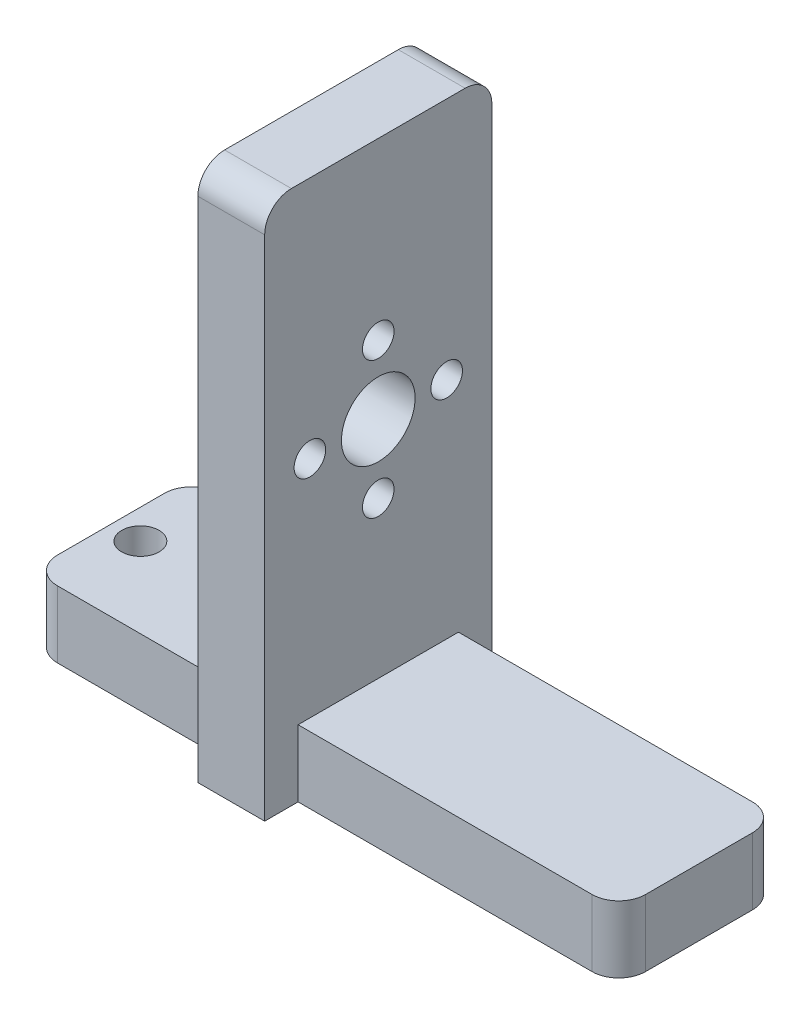
ISO-10303-21;
HEADER;
FILE_DESCRIPTION(('STEP AP214'),'2;1');
FILE_NAME('part.step','',(''),(''),'','','');
FILE_SCHEMA(('AUTOMOTIVE_DESIGN { 1 0 10303 214 1 1 1 1 }'));
ENDSEC;
DATA;
#1=APPLICATION_CONTEXT('core data for automotive mechanical design processes');
#2=APPLICATION_PROTOCOL_DEFINITION('international standard','automotive_design',2000,#1);
#3=PRODUCT_CONTEXT('',#1,'mechanical');
#4=PRODUCT('Part','Part','',(#3));
#5=PRODUCT_RELATED_PRODUCT_CATEGORY('part','',(#4));
#6=PRODUCT_DEFINITION_FORMATION('','',#4);
#7=PRODUCT_DEFINITION_CONTEXT('part definition',#1,'design');
#8=PRODUCT_DEFINITION('design','',#6,#7);
#9=PRODUCT_DEFINITION_SHAPE('','',#8);
#10=(LENGTH_UNIT() NAMED_UNIT(*) SI_UNIT(.MILLI.,.METRE.));
#11=(NAMED_UNIT(*) PLANE_ANGLE_UNIT() SI_UNIT($,.RADIAN.));
#12=(NAMED_UNIT(*) SI_UNIT($,.STERADIAN.) SOLID_ANGLE_UNIT());
#13=UNCERTAINTY_MEASURE_WITH_UNIT(LENGTH_MEASURE(1.E-05),#10,'distance_accuracy_value','');
#14=(GEOMETRIC_REPRESENTATION_CONTEXT(3) GLOBAL_UNCERTAINTY_ASSIGNED_CONTEXT((#13)) GLOBAL_UNIT_ASSIGNED_CONTEXT((#10,
#11,#12)) REPRESENTATION_CONTEXT('',''));
#15=CARTESIAN_POINT('',(0.,0.,0.));
#16=DIRECTION('',(0.,0.,1.));
#17=DIRECTION('',(1.,0.,0.));
#18=AXIS2_PLACEMENT_3D('',#15,#16,#17);
#19=CARTESIAN_POINT('',(0.,0.,15.24));
#20=DIRECTION('',(0.,0.,1.));
#21=DIRECTION('',(1.,0.,0.));
#22=AXIS2_PLACEMENT_3D('',#19,#20,#21);
#23=PLANE('',#22);
#24=DIRECTION('',(1.,0.,0.));
#25=VECTOR('',#24,1.);
#26=CARTESIAN_POINT('',(-27.94,0.,15.24));
#27=LINE('',#26,#25);
#28=CARTESIAN_POINT('',(-2.54,0.,15.24));
#29=VERTEX_POINT('',#28);
#30=CARTESIAN_POINT('',(25.4,0.,15.24));
#31=VERTEX_POINT('',#30);
#32=EDGE_CURVE('E182',#29,#31,#27,.T.);
#33=ORIENTED_EDGE('',*,*,#32,.T.);
#34=DIRECTION('',(0.,1.,0.));
#35=VECTOR('',#34,1.);
#36=CARTESIAN_POINT('',(25.4,6.35,15.24));
#37=LINE('',#36,#35);
#38=CARTESIAN_POINT('',(25.4,6.35,15.24));
#39=VERTEX_POINT('',#38);
#40=EDGE_CURVE('E193',#31,#39,#37,.T.);
#41=ORIENTED_EDGE('',*,*,#40,.T.);
#42=DIRECTION('',(-1.,0.,0.));
#43=VECTOR('',#42,1.);
#44=CARTESIAN_POINT('',(27.94,6.35,15.24));
#45=LINE('',#44,#43);
#46=CARTESIAN_POINT('',(-2.54,6.34999999999999,15.24));
#47=VERTEX_POINT('',#46);
#48=EDGE_CURVE('E234',#39,#47,#45,.T.);
#49=ORIENTED_EDGE('',*,*,#48,.T.);
#50=DIRECTION('',(0.,-1.,0.));
#51=VECTOR('',#50,1.);
#52=CARTESIAN_POINT('',(-2.54,50.8,15.24));
#53=LINE('',#52,#51);
#54=EDGE_CURVE('E187',#47,#29,#53,.T.);
#55=ORIENTED_EDGE('',*,*,#54,.T.);
#56=EDGE_LOOP('',(#33,#41,#49,#55));
#57=FACE_BOUND('',#56,.T.);
#58=ADVANCED_FACE('F33',(#57),#23,.T.);
#59=CARTESIAN_POINT('',(0.,0.,0.));
#60=DIRECTION('',(0.,0.,1.));
#61=DIRECTION('',(1.,0.,0.));
#62=AXIS2_PLACEMENT_3D('',#59,#60,#61);
#63=PLANE('',#62);
#64=DIRECTION('',(1.,0.,0.));
#65=VECTOR('',#64,1.);
#66=CARTESIAN_POINT('',(-27.94,0.,0.));
#67=LINE('',#66,#65);
#68=CARTESIAN_POINT('',(-25.4,0.,0.));
#69=VERTEX_POINT('',#68);
#70=CARTESIAN_POINT('',(-8.89,0.,0.));
#71=VERTEX_POINT('',#70);
#72=EDGE_CURVE('E240',#69,#71,#67,.T.);
#73=ORIENTED_EDGE('',*,*,#72,.F.);
#74=DIRECTION('',(0.,-1.,0.));
#75=VECTOR('',#74,1.);
#76=CARTESIAN_POINT('',(-25.4,0.,0.));
#77=LINE('',#76,#75);
#78=CARTESIAN_POINT('',(-25.4,6.35,0.));
#79=VERTEX_POINT('',#78);
#80=EDGE_CURVE('E302',#69,#79,#77,.F.);
#81=ORIENTED_EDGE('',*,*,#80,.T.);
#82=DIRECTION('',(-1.,0.,0.));
#83=VECTOR('',#82,1.);
#84=CARTESIAN_POINT('',(-8.89,6.35,0.));
#85=LINE('',#84,#83);
#86=CARTESIAN_POINT('',(-8.89,6.35,0.));
#87=VERTEX_POINT('',#86);
#88=EDGE_CURVE('E244',#87,#79,#85,.T.);
#89=ORIENTED_EDGE('',*,*,#88,.F.);
#90=DIRECTION('',(0.,1.,0.));
#91=VECTOR('',#90,1.);
#92=CARTESIAN_POINT('',(-8.89,50.8,0.));
#93=LINE('',#92,#91);
#94=EDGE_CURVE('E170',#71,#87,#93,.T.);
#95=ORIENTED_EDGE('',*,*,#94,.F.);
#96=EDGE_LOOP('',(#73,#81,#89,#95));
#97=FACE_BOUND('',#96,.T.);
#98=ADVANCED_FACE('F350',(#97),#63,.F.);
#99=CARTESIAN_POINT('',(-27.94,6.35,15.24));
#100=DIRECTION('',(1.,0.,0.));
#101=DIRECTION('',(0.,0.,-1.));
#102=AXIS2_PLACEMENT_3D('',#99,#100,#101);
#103=PLANE('',#102);
#104=DIRECTION('',(0.,0.,-1.));
#105=VECTOR('',#104,1.);
#106=CARTESIAN_POINT('',(-27.94,0.,15.24));
#107=LINE('',#106,#105);
#108=CARTESIAN_POINT('',(-27.94,0.,12.7));
#109=VERTEX_POINT('',#108);
#110=CARTESIAN_POINT('',(-27.94,0.,2.54));
#111=VERTEX_POINT('',#110);
#112=EDGE_CURVE('E266',#109,#111,#107,.T.);
#113=ORIENTED_EDGE('',*,*,#112,.F.);
#114=DIRECTION('',(0.,-1.,0.));
#115=VECTOR('',#114,1.);
#116=CARTESIAN_POINT('',(-27.94,6.35,12.7));
#117=LINE('',#116,#115);
#118=CARTESIAN_POINT('',(-27.94,6.35,12.7));
#119=VERTEX_POINT('',#118);
#120=EDGE_CURVE('E296',#109,#119,#117,.F.);
#121=ORIENTED_EDGE('',*,*,#120,.T.);
#122=DIRECTION('',(0.,0.,-1.));
#123=VECTOR('',#122,1.);
#124=CARTESIAN_POINT('',(-27.94,6.35,15.24));
#125=LINE('',#124,#123);
#126=CARTESIAN_POINT('',(-27.94,6.35,2.54));
#127=VERTEX_POINT('',#126);
#128=EDGE_CURVE('E239',#119,#127,#125,.T.);
#129=ORIENTED_EDGE('',*,*,#128,.T.);
#130=DIRECTION('',(0.,-1.,0.));
#131=VECTOR('',#130,1.);
#132=CARTESIAN_POINT('',(-27.94,6.35,2.54));
#133=LINE('',#132,#131);
#134=EDGE_CURVE('E293',#127,#111,#133,.T.);
#135=ORIENTED_EDGE('',*,*,#134,.T.);
#136=EDGE_LOOP('',(#113,#121,#129,#135));
#137=FACE_BOUND('',#136,.T.);
#138=ADVANCED_FACE('F337',(#137),#103,.F.);
#139=CARTESIAN_POINT('',(-27.94,0.,15.24));
#140=DIRECTION('',(0.,1.,0.));
#141=DIRECTION('',(0.,0.,1.));
#142=AXIS2_PLACEMENT_3D('',#139,#140,#141);
#143=PLANE('',#142);
#144=CARTESIAN_POINT('',(-25.146,0.,7.62));
#145=DIRECTION('',(0.,1.,0.));
#146=DIRECTION('',(0.,0.,1.));
#147=AXIS2_PLACEMENT_3D('',#144,#145,#146);
#148=CIRCLE('',#147,1.778);
#149=CARTESIAN_POINT('',(-25.146,0.,9.398));
#150=VERTEX_POINT('',#149);
#151=EDGE_CURVE('E222',#150,#150,#148,.T.);
#152=ORIENTED_EDGE('',*,*,#151,.T.);
#153=EDGE_LOOP('',(#152));
#154=FACE_BOUND('',#153,.T.);
#155=CARTESIAN_POINT('',(-15.24,0.,7.62));
#156=DIRECTION('',(0.,1.,0.));
#157=DIRECTION('',(0.,0.,1.));
#158=AXIS2_PLACEMENT_3D('',#155,#156,#157);
#159=CIRCLE('',#158,1.778);
#160=CARTESIAN_POINT('',(-15.24,0.,9.398));
#161=VERTEX_POINT('',#160);
#162=EDGE_CURVE('E217',#161,#161,#159,.T.);
#163=ORIENTED_EDGE('',*,*,#162,.T.);
#164=EDGE_LOOP('',(#163));
#165=FACE_BOUND('',#164,.T.);
#166=DIRECTION('',(0.,0.,-1.));
#167=VECTOR('',#166,1.);
#168=CARTESIAN_POINT('',(27.94,0.,15.24));
#169=LINE('',#168,#167);
#170=CARTESIAN_POINT('',(27.94,0.,12.7));
#171=VERTEX_POINT('',#170);
#172=CARTESIAN_POINT('',(27.94,0.,2.54));
#173=VERTEX_POINT('',#172);
#174=EDGE_CURVE('E263',#171,#173,#169,.T.);
#175=ORIENTED_EDGE('',*,*,#174,.F.);
#176=CARTESIAN_POINT('',(25.4,0.,12.7));
#177=DIRECTION('',(0.,1.,0.));
#178=DIRECTION('',(0.,0.,1.));
#179=AXIS2_PLACEMENT_3D('',#176,#177,#178);
#180=CIRCLE('',#179,2.54);
#181=EDGE_CURVE('E286',#171,#31,#180,.F.);
#182=ORIENTED_EDGE('',*,*,#181,.T.);
#183=ORIENTED_EDGE('',*,*,#32,.F.);
#184=DIRECTION('',(0.,0.,1.));
#185=VECTOR('',#184,1.);
#186=CARTESIAN_POINT('',(-2.54,0.,15.24));
#187=LINE('',#186,#185);
#188=CARTESIAN_POINT('',(-2.54,0.,18.415));
#189=VERTEX_POINT('',#188);
#190=EDGE_CURVE('E174',#29,#189,#187,.T.);
#191=ORIENTED_EDGE('',*,*,#190,.T.);
#192=DIRECTION('',(-1.,0.,0.));
#193=VECTOR('',#192,1.);
#194=CARTESIAN_POINT('',(-2.54,0.,18.415));
#195=LINE('',#194,#193);
#196=CARTESIAN_POINT('',(-8.89,0.,18.415));
#197=VERTEX_POINT('',#196);
#198=EDGE_CURVE('E158',#189,#197,#195,.T.);
#199=ORIENTED_EDGE('',*,*,#198,.T.);
#200=DIRECTION('',(0.,0.,1.));
#201=VECTOR('',#200,1.);
#202=CARTESIAN_POINT('',(-8.89,0.,15.24));
#203=LINE('',#202,#201);
#204=CARTESIAN_POINT('',(-8.89,0.,15.24));
#205=VERTEX_POINT('',#204);
#206=EDGE_CURVE('E184',#205,#197,#203,.T.);
#207=ORIENTED_EDGE('',*,*,#206,.F.);
#208=CARTESIAN_POINT('',(-25.4,0.,15.24));
#209=VERTEX_POINT('',#208);
#210=EDGE_CURVE('E232',#209,#205,#27,.T.);
#211=ORIENTED_EDGE('',*,*,#210,.F.);
#212=CARTESIAN_POINT('',(-25.4,0.,12.7));
#213=DIRECTION('',(0.,1.,0.));
#214=DIRECTION('',(0.,0.,1.));
#215=AXIS2_PLACEMENT_3D('',#212,#213,#214);
#216=CIRCLE('',#215,2.54);
#217=EDGE_CURVE('E282',#209,#109,#216,.F.);
#218=ORIENTED_EDGE('',*,*,#217,.T.);
#219=ORIENTED_EDGE('',*,*,#112,.T.);
#220=CARTESIAN_POINT('',(-25.4,0.,2.54));
#221=DIRECTION('',(0.,1.,0.));
#222=DIRECTION('',(0.,0.,1.));
#223=AXIS2_PLACEMENT_3D('',#220,#221,#222);
#224=CIRCLE('',#223,2.54);
#225=EDGE_CURVE('E280',#111,#69,#224,.F.);
#226=ORIENTED_EDGE('',*,*,#225,.T.);
#227=ORIENTED_EDGE('',*,*,#72,.T.);
#228=DIRECTION('',(0.,0.,1.));
#229=VECTOR('',#228,1.);
#230=CARTESIAN_POINT('',(-8.89,0.,0.));
#231=LINE('',#230,#229);
#232=CARTESIAN_POINT('',(-8.89,0.,-3.17499999999999));
#233=VERTEX_POINT('',#232);
#234=EDGE_CURVE('E200',#233,#71,#231,.T.);
#235=ORIENTED_EDGE('',*,*,#234,.F.);
#236=DIRECTION('',(-1.,0.,0.));
#237=VECTOR('',#236,1.);
#238=CARTESIAN_POINT('',(-2.54,0.,-3.17499999999999));
#239=LINE('',#238,#237);
#240=CARTESIAN_POINT('',(-2.54,0.,-3.17499999999999));
#241=VERTEX_POINT('',#240);
#242=EDGE_CURVE('E205',#241,#233,#239,.T.);
#243=ORIENTED_EDGE('',*,*,#242,.F.);
#244=DIRECTION('',(0.,0.,1.));
#245=VECTOR('',#244,1.);
#246=CARTESIAN_POINT('',(-2.54,0.,0.));
#247=LINE('',#246,#245);
#248=CARTESIAN_POINT('',(-2.54,0.,0.));
#249=VERTEX_POINT('',#248);
#250=EDGE_CURVE('E202',#241,#249,#247,.T.);
#251=ORIENTED_EDGE('',*,*,#250,.T.);
#252=CARTESIAN_POINT('',(25.4,0.,0.));
#253=VERTEX_POINT('',#252);
#254=EDGE_CURVE('E231',#249,#253,#67,.T.);
#255=ORIENTED_EDGE('',*,*,#254,.T.);
#256=CARTESIAN_POINT('',(25.4,0.,2.54));
#257=DIRECTION('',(0.,1.,0.));
#258=DIRECTION('',(0.,0.,1.));
#259=AXIS2_PLACEMENT_3D('',#256,#257,#258);
#260=CIRCLE('',#259,2.54);
#261=EDGE_CURVE('E284',#253,#173,#260,.F.);
#262=ORIENTED_EDGE('',*,*,#261,.T.);
#263=EDGE_LOOP('',(#175,#182,#183,#191,#199,#207,#211,#218,#219,#226,#227,#235,#243,#251,#255,#262));
#264=FACE_BOUND('',#263,.T.);
#265=ADVANCED_FACE('F180',(#154,#165,#264),#143,.F.);
#266=CARTESIAN_POINT('',(27.94,0.,15.24));
#267=DIRECTION('',(-1.,0.,0.));
#268=DIRECTION('',(0.,0.,1.));
#269=AXIS2_PLACEMENT_3D('',#266,#267,#268);
#270=PLANE('',#269);
#271=DIRECTION('',(0.,0.,-1.));
#272=VECTOR('',#271,1.);
#273=CARTESIAN_POINT('',(27.94,6.35,15.24));
#274=LINE('',#273,#272);
#275=CARTESIAN_POINT('',(27.94,6.35,12.7));
#276=VERTEX_POINT('',#275);
#277=CARTESIAN_POINT('',(27.94,6.35,2.54));
#278=VERTEX_POINT('',#277);
#279=EDGE_CURVE('E260',#276,#278,#274,.T.);
#280=ORIENTED_EDGE('',*,*,#279,.F.);
#281=DIRECTION('',(0.,1.,0.));
#282=VECTOR('',#281,1.);
#283=CARTESIAN_POINT('',(27.94,0.,12.7));
#284=LINE('',#283,#282);
#285=EDGE_CURVE('E278',#276,#171,#284,.F.);
#286=ORIENTED_EDGE('',*,*,#285,.T.);
#287=ORIENTED_EDGE('',*,*,#174,.T.);
#288=DIRECTION('',(0.,1.,0.));
#289=VECTOR('',#288,1.);
#290=CARTESIAN_POINT('',(27.94,0.,2.54));
#291=LINE('',#290,#289);
#292=EDGE_CURVE('E275',#173,#278,#291,.T.);
#293=ORIENTED_EDGE('',*,*,#292,.T.);
#294=EDGE_LOOP('',(#280,#286,#287,#293));
#295=FACE_BOUND('',#294,.T.);
#296=ADVANCED_FACE('F366',(#295),#270,.F.);
#297=CARTESIAN_POINT('',(27.94,6.35,15.24));
#298=DIRECTION('',(0.,-1.,0.));
#299=DIRECTION('',(1.,0.,0.));
#300=AXIS2_PLACEMENT_3D('',#297,#298,#299);
#301=PLANE('',#300);
#302=ORIENTED_EDGE('',*,*,#48,.F.);
#303=CARTESIAN_POINT('',(25.4,6.35,12.7));
#304=DIRECTION('',(0.,-1.,0.));
#305=DIRECTION('',(1.,0.,0.));
#306=AXIS2_PLACEMENT_3D('',#303,#304,#305);
#307=CIRCLE('',#306,2.54);
#308=EDGE_CURVE('E273',#39,#276,#307,.F.);
#309=ORIENTED_EDGE('',*,*,#308,.T.);
#310=ORIENTED_EDGE('',*,*,#279,.T.);
#311=CARTESIAN_POINT('',(25.4,6.35,2.54));
#312=DIRECTION('',(0.,-1.,0.));
#313=DIRECTION('',(1.,0.,0.));
#314=AXIS2_PLACEMENT_3D('',#311,#312,#313);
#315=CIRCLE('',#314,2.54);
#316=CARTESIAN_POINT('',(25.4,6.35,0.));
#317=VERTEX_POINT('',#316);
#318=EDGE_CURVE('E271',#278,#317,#315,.F.);
#319=ORIENTED_EDGE('',*,*,#318,.T.);
#320=DIRECTION('',(-1.,0.,0.));
#321=VECTOR('',#320,1.);
#322=CARTESIAN_POINT('',(27.94,6.35,0.));
#323=LINE('',#322,#321);
#324=CARTESIAN_POINT('',(-2.54,6.34999999999999,0.));
#325=VERTEX_POINT('',#324);
#326=EDGE_CURVE('E242',#317,#325,#323,.T.);
#327=ORIENTED_EDGE('',*,*,#326,.T.);
#328=DIRECTION('',(0.,0.,-1.));
#329=VECTOR('',#328,1.);
#330=CARTESIAN_POINT('',(-2.54,6.35,15.24));
#331=LINE('',#330,#329);
#332=EDGE_CURVE('E257',#47,#325,#331,.T.);
#333=ORIENTED_EDGE('',*,*,#332,.F.);
#334=EDGE_LOOP('',(#302,#309,#310,#319,#327,#333));
#335=FACE_BOUND('',#334,.T.);
#336=ADVANCED_FACE('F370',(#335),#301,.F.);
#337=CARTESIAN_POINT('',(-2.54,6.35,15.24));
#338=DIRECTION('',(-1.,0.,0.));
#339=DIRECTION('',(0.,-1.,0.));
#340=AXIS2_PLACEMENT_3D('',#337,#338,#339);
#341=PLANE('',#340);
#342=CARTESIAN_POINT('',(-2.54,27.686,1.12));
#343=DIRECTION('',(-1.,0.,0.));
#344=DIRECTION('',(0.,0.,1.));
#345=AXIS2_PLACEMENT_3D('',#342,#343,#344);
#346=CIRCLE('',#345,1.5);
#347=CARTESIAN_POINT('',(-2.54,27.686,2.62));
#348=VERTEX_POINT('',#347);
#349=EDGE_CURVE('E550',#348,#348,#346,.T.);
#350=ORIENTED_EDGE('',*,*,#349,.T.);
#351=EDGE_LOOP('',(#350));
#352=FACE_BOUND('',#351,.T.);
#353=CARTESIAN_POINT('',(-2.54,21.186,7.62));
#354=DIRECTION('',(-1.,0.,0.));
#355=DIRECTION('',(0.,1.,0.));
#356=AXIS2_PLACEMENT_3D('',#353,#354,#355);
#357=CIRCLE('',#356,1.5);
#358=CARTESIAN_POINT('',(-2.54,22.686,7.62));
#359=VERTEX_POINT('',#358);
#360=EDGE_CURVE('E554',#359,#359,#357,.T.);
#361=ORIENTED_EDGE('',*,*,#360,.T.);
#362=EDGE_LOOP('',(#361));
#363=FACE_BOUND('',#362,.T.);
#364=CARTESIAN_POINT('',(-2.54,27.6860000000001,14.12));
#365=DIRECTION('',(-1.,0.,0.));
#366=DIRECTION('',(0.,0.,-1.));
#367=AXIS2_PLACEMENT_3D('',#364,#365,#366);
#368=CIRCLE('',#367,1.5);
#369=CARTESIAN_POINT('',(-2.54,27.6860000000001,12.62));
#370=VERTEX_POINT('',#369);
#371=EDGE_CURVE('E564',#370,#370,#368,.T.);
#372=ORIENTED_EDGE('',*,*,#371,.T.);
#373=EDGE_LOOP('',(#372));
#374=FACE_BOUND('',#373,.T.);
#375=CARTESIAN_POINT('',(-2.54,34.186,7.62));
#376=DIRECTION('',(-1.,0.,0.));
#377=DIRECTION('',(0.,-1.,0.));
#378=AXIS2_PLACEMENT_3D('',#375,#376,#377);
#379=CIRCLE('',#378,1.5);
#380=CARTESIAN_POINT('',(-2.54,32.686,7.62));
#381=VERTEX_POINT('',#380);
#382=EDGE_CURVE('E194',#381,#381,#379,.T.);
#383=ORIENTED_EDGE('',*,*,#382,.T.);
#384=EDGE_LOOP('',(#383));
#385=FACE_BOUND('',#384,.T.);
#386=CARTESIAN_POINT('',(-2.54,27.686,7.62));
#387=DIRECTION('',(-1.,0.,0.));
#388=DIRECTION('',(0.,-1.,0.));
#389=AXIS2_PLACEMENT_3D('',#386,#387,#388);
#390=CIRCLE('',#389,3.5);
#391=CARTESIAN_POINT('',(-2.54,24.186,7.62));
#392=VERTEX_POINT('',#391);
#393=EDGE_CURVE('E228',#392,#392,#390,.T.);
#394=ORIENTED_EDGE('',*,*,#393,.T.);
#395=EDGE_LOOP('',(#394));
#396=FACE_BOUND('',#395,.T.);
#397=DIRECTION('',(0.,0.,-1.));
#398=VECTOR('',#397,1.);
#399=CARTESIAN_POINT('',(-2.54,50.8,15.24));
#400=LINE('',#399,#398);
#401=CARTESIAN_POINT('',(-2.54,50.8,15.875));
#402=VERTEX_POINT('',#401);
#403=CARTESIAN_POINT('',(-2.54,50.8,-0.634999999999991));
#404=VERTEX_POINT('',#403);
#405=EDGE_CURVE('E255',#402,#404,#400,.T.);
#406=ORIENTED_EDGE('',*,*,#405,.F.);
#407=CARTESIAN_POINT('',(-2.54,48.26,15.875));
#408=DIRECTION('',(-1.,0.,0.));
#409=DIRECTION('',(0.,-1.,0.));
#410=AXIS2_PLACEMENT_3D('',#407,#408,#409);
#411=CIRCLE('',#410,2.54);
#412=CARTESIAN_POINT('',(-2.54,48.26,18.415));
#413=VERTEX_POINT('',#412);
#414=EDGE_CURVE('E41',#402,#413,#411,.F.);
#415=ORIENTED_EDGE('',*,*,#414,.T.);
#416=DIRECTION('',(0.,1.,0.));
#417=VECTOR('',#416,1.);
#418=CARTESIAN_POINT('',(-2.54,50.8,18.415));
#419=LINE('',#418,#417);
#420=EDGE_CURVE('E162',#189,#413,#419,.T.);
#421=ORIENTED_EDGE('',*,*,#420,.F.);
#422=ORIENTED_EDGE('',*,*,#190,.F.);
#423=ORIENTED_EDGE('',*,*,#54,.F.);
#424=ORIENTED_EDGE('',*,*,#332,.T.);
#425=DIRECTION('',(0.,1.,0.));
#426=VECTOR('',#425,1.);
#427=CARTESIAN_POINT('',(-2.54,50.8,0.));
#428=LINE('',#427,#426);
#429=EDGE_CURVE('E196',#249,#325,#428,.T.);
#430=ORIENTED_EDGE('',*,*,#429,.F.);
#431=ORIENTED_EDGE('',*,*,#250,.F.);
#432=DIRECTION('',(0.,-1.,0.));
#433=VECTOR('',#432,1.);
#434=CARTESIAN_POINT('',(-2.54,50.8,-3.175));
#435=LINE('',#434,#433);
#436=CARTESIAN_POINT('',(-2.54,48.26,-3.175));
#437=VERTEX_POINT('',#436);
#438=EDGE_CURVE('E199',#437,#241,#435,.T.);
#439=ORIENTED_EDGE('',*,*,#438,.F.);
#440=CARTESIAN_POINT('',(-2.54,48.26,-0.634999999999998));
#441=DIRECTION('',(-1.,0.,0.));
#442=DIRECTION('',(0.,-1.,0.));
#443=AXIS2_PLACEMENT_3D('',#440,#441,#442);
#444=CIRCLE('',#443,2.54);
#445=EDGE_CURVE('E53',#437,#404,#444,.F.);
#446=ORIENTED_EDGE('',*,*,#445,.T.);
#447=EDGE_LOOP('',(#406,#415,#421,#422,#423,#424,#430,#431,#439,#446));
#448=FACE_BOUND('',#447,.T.);
#449=ADVANCED_FACE('F172',(#352,#363,#374,#385,#396,#448),#341,.F.);
#450=CARTESIAN_POINT('',(-2.54,50.8,15.24));
#451=DIRECTION('',(0.,-1.,0.));
#452=DIRECTION('',(0.,0.,-1.));
#453=AXIS2_PLACEMENT_3D('',#450,#451,#452);
#454=PLANE('',#453);
#455=DIRECTION('',(0.,0.,-1.));
#456=VECTOR('',#455,1.);
#457=CARTESIAN_POINT('',(-8.89,50.8,15.24));
#458=LINE('',#457,#456);
#459=CARTESIAN_POINT('',(-8.89,50.8,15.875));
#460=VERTEX_POINT('',#459);
#461=CARTESIAN_POINT('',(-8.89,50.8,-0.634999999999991));
#462=VERTEX_POINT('',#461);
#463=EDGE_CURVE('E252',#460,#462,#458,.T.);
#464=ORIENTED_EDGE('',*,*,#463,.F.);
#465=DIRECTION('',(-1.,0.,0.));
#466=VECTOR('',#465,1.);
#467=CARTESIAN_POINT('',(-2.54,50.8,15.875));
#468=LINE('',#467,#466);
#469=EDGE_CURVE('E313',#460,#402,#468,.F.);
#470=ORIENTED_EDGE('',*,*,#469,.T.);
#471=ORIENTED_EDGE('',*,*,#405,.T.);
#472=DIRECTION('',(-1.,0.,0.));
#473=VECTOR('',#472,1.);
#474=CARTESIAN_POINT('',(-8.89,50.8,-0.634999999999998));
#475=LINE('',#474,#473);
#476=EDGE_CURVE('E310',#404,#462,#475,.T.);
#477=ORIENTED_EDGE('',*,*,#476,.T.);
#478=EDGE_LOOP('',(#464,#470,#471,#477));
#479=FACE_BOUND('',#478,.T.);
#480=ADVANCED_FACE('F318',(#479),#454,.F.);
#481=CARTESIAN_POINT('',(-8.89,50.8,15.24));
#482=DIRECTION('',(1.,0.,0.));
#483=DIRECTION('',(0.,1.,0.));
#484=AXIS2_PLACEMENT_3D('',#481,#482,#483);
#485=PLANE('',#484);
#486=CARTESIAN_POINT('',(-8.89,27.686,1.12));
#487=DIRECTION('',(-1.,0.,0.));
#488=DIRECTION('',(0.,0.,1.));
#489=AXIS2_PLACEMENT_3D('',#486,#487,#488);
#490=CIRCLE('',#489,1.5);
#491=CARTESIAN_POINT('',(-8.89,27.686,2.62));
#492=VERTEX_POINT('',#491);
#493=EDGE_CURVE('E553',#492,#492,#490,.T.);
#494=ORIENTED_EDGE('',*,*,#493,.F.);
#495=EDGE_LOOP('',(#494));
#496=FACE_BOUND('',#495,.T.);
#497=CARTESIAN_POINT('',(-8.89,21.186,7.62));
#498=DIRECTION('',(-1.,0.,0.));
#499=DIRECTION('',(0.,1.,0.));
#500=AXIS2_PLACEMENT_3D('',#497,#498,#499);
#501=CIRCLE('',#500,1.5);
#502=CARTESIAN_POINT('',(-8.89,22.686,7.62));
#503=VERTEX_POINT('',#502);
#504=EDGE_CURVE('E559',#503,#503,#501,.T.);
#505=ORIENTED_EDGE('',*,*,#504,.F.);
#506=EDGE_LOOP('',(#505));
#507=FACE_BOUND('',#506,.T.);
#508=CARTESIAN_POINT('',(-8.89,27.6860000000001,14.12));
#509=DIRECTION('',(-1.,0.,0.));
#510=DIRECTION('',(0.,0.,-1.));
#511=AXIS2_PLACEMENT_3D('',#508,#509,#510);
#512=CIRCLE('',#511,1.5);
#513=CARTESIAN_POINT('',(-8.89,27.6860000000001,12.62));
#514=VERTEX_POINT('',#513);
#515=EDGE_CURVE('E567',#514,#514,#512,.T.);
#516=ORIENTED_EDGE('',*,*,#515,.F.);
#517=EDGE_LOOP('',(#516));
#518=FACE_BOUND('',#517,.T.);
#519=CARTESIAN_POINT('',(-8.89,34.186,7.62));
#520=DIRECTION('',(-1.,0.,0.));
#521=DIRECTION('',(0.,-1.,0.));
#522=AXIS2_PLACEMENT_3D('',#519,#520,#521);
#523=CIRCLE('',#522,1.5);
#524=CARTESIAN_POINT('',(-8.89,32.686,7.62));
#525=VERTEX_POINT('',#524);
#526=EDGE_CURVE('E556',#525,#525,#523,.T.);
#527=ORIENTED_EDGE('',*,*,#526,.F.);
#528=EDGE_LOOP('',(#527));
#529=FACE_BOUND('',#528,.T.);
#530=CARTESIAN_POINT('',(-8.89,27.686,7.62));
#531=DIRECTION('',(-1.,0.,0.));
#532=DIRECTION('',(0.,-1.,0.));
#533=AXIS2_PLACEMENT_3D('',#530,#531,#532);
#534=CIRCLE('',#533,3.5);
#535=CARTESIAN_POINT('',(-8.89,24.186,7.62));
#536=VERTEX_POINT('',#535);
#537=EDGE_CURVE('E225',#536,#536,#534,.T.);
#538=ORIENTED_EDGE('',*,*,#537,.F.);
#539=EDGE_LOOP('',(#538));
#540=FACE_BOUND('',#539,.T.);
#541=DIRECTION('',(0.,1.,0.));
#542=VECTOR('',#541,1.);
#543=CARTESIAN_POINT('',(-8.89,50.8,18.415));
#544=LINE('',#543,#542);
#545=CARTESIAN_POINT('',(-8.89,48.26,18.415));
#546=VERTEX_POINT('',#545);
#547=EDGE_CURVE('E165',#197,#546,#544,.T.);
#548=ORIENTED_EDGE('',*,*,#547,.T.);
#549=CARTESIAN_POINT('',(-8.89,48.26,15.875));
#550=DIRECTION('',(1.,0.,0.));
#551=DIRECTION('',(0.,1.,0.));
#552=AXIS2_PLACEMENT_3D('',#549,#550,#551);
#553=CIRCLE('',#552,2.54);
#554=EDGE_CURVE('E308',#546,#460,#553,.F.);
#555=ORIENTED_EDGE('',*,*,#554,.T.);
#556=ORIENTED_EDGE('',*,*,#463,.T.);
#557=CARTESIAN_POINT('',(-8.89,48.26,-0.634999999999998));
#558=DIRECTION('',(1.,0.,0.));
#559=DIRECTION('',(0.,1.,0.));
#560=AXIS2_PLACEMENT_3D('',#557,#558,#559);
#561=CIRCLE('',#560,2.54);
#562=CARTESIAN_POINT('',(-8.89,48.26,-3.175));
#563=VERTEX_POINT('',#562);
#564=EDGE_CURVE('E306',#462,#563,#561,.F.);
#565=ORIENTED_EDGE('',*,*,#564,.T.);
#566=DIRECTION('',(0.,-1.,0.));
#567=VECTOR('',#566,1.);
#568=CARTESIAN_POINT('',(-8.89,50.8,-3.175));
#569=LINE('',#568,#567);
#570=EDGE_CURVE('E207',#563,#233,#569,.T.);
#571=ORIENTED_EDGE('',*,*,#570,.T.);
#572=ORIENTED_EDGE('',*,*,#234,.T.);
#573=ORIENTED_EDGE('',*,*,#94,.T.);
#574=DIRECTION('',(0.,0.,-1.));
#575=VECTOR('',#574,1.);
#576=CARTESIAN_POINT('',(-8.89,6.35,15.24));
#577=LINE('',#576,#575);
#578=CARTESIAN_POINT('',(-8.89,6.35,15.24));
#579=VERTEX_POINT('',#578);
#580=EDGE_CURVE('E249',#579,#87,#577,.T.);
#581=ORIENTED_EDGE('',*,*,#580,.F.);
#582=DIRECTION('',(0.,-1.,0.));
#583=VECTOR('',#582,1.);
#584=CARTESIAN_POINT('',(-8.89,50.8,15.24));
#585=LINE('',#584,#583);
#586=EDGE_CURVE('E190',#579,#205,#585,.T.);
#587=ORIENTED_EDGE('',*,*,#586,.T.);
#588=ORIENTED_EDGE('',*,*,#206,.T.);
#589=EDGE_LOOP('',(#548,#555,#556,#565,#571,#572,#573,#581,#587,#588));
#590=FACE_BOUND('',#589,.T.);
#591=ADVANCED_FACE('F323',(#496,#507,#518,#529,#540,#590),#485,.F.);
#592=CARTESIAN_POINT('',(-8.89,6.35,15.24));
#593=DIRECTION('',(0.,-1.,0.));
#594=DIRECTION('',(1.,0.,0.));
#595=AXIS2_PLACEMENT_3D('',#592,#593,#594);
#596=PLANE('',#595);
#597=CARTESIAN_POINT('',(-25.146,6.35,7.62));
#598=DIRECTION('',(0.,1.,0.));
#599=DIRECTION('',(-1.,0.,0.));
#600=AXIS2_PLACEMENT_3D('',#597,#598,#599);
#601=CIRCLE('',#600,1.778);
#602=CARTESIAN_POINT('',(-26.924,6.35,7.62));
#603=VERTEX_POINT('',#602);
#604=EDGE_CURVE('E214',#603,#603,#601,.T.);
#605=ORIENTED_EDGE('',*,*,#604,.F.);
#606=EDGE_LOOP('',(#605));
#607=FACE_BOUND('',#606,.T.);
#608=CARTESIAN_POINT('',(-15.24,6.35,7.62));
#609=DIRECTION('',(0.,1.,0.));
#610=DIRECTION('',(-1.,0.,0.));
#611=AXIS2_PLACEMENT_3D('',#608,#609,#610);
#612=CIRCLE('',#611,1.778);
#613=CARTESIAN_POINT('',(-17.018,6.35,7.62));
#614=VERTEX_POINT('',#613);
#615=EDGE_CURVE('E213',#614,#614,#612,.T.);
#616=ORIENTED_EDGE('',*,*,#615,.F.);
#617=EDGE_LOOP('',(#616));
#618=FACE_BOUND('',#617,.T.);
#619=ORIENTED_EDGE('',*,*,#128,.F.);
#620=CARTESIAN_POINT('',(-25.4,6.35,12.7));
#621=DIRECTION('',(0.,-1.,0.));
#622=DIRECTION('',(1.,0.,0.));
#623=AXIS2_PLACEMENT_3D('',#620,#621,#622);
#624=CIRCLE('',#623,2.54);
#625=CARTESIAN_POINT('',(-25.4,6.35,15.24));
#626=VERTEX_POINT('',#625);
#627=EDGE_CURVE('E300',#119,#626,#624,.F.);
#628=ORIENTED_EDGE('',*,*,#627,.T.);
#629=DIRECTION('',(-1.,0.,0.));
#630=VECTOR('',#629,1.);
#631=CARTESIAN_POINT('',(-8.89,6.35,15.24));
#632=LINE('',#631,#630);
#633=EDGE_CURVE('E236',#579,#626,#632,.T.);
#634=ORIENTED_EDGE('',*,*,#633,.F.);
#635=ORIENTED_EDGE('',*,*,#580,.T.);
#636=ORIENTED_EDGE('',*,*,#88,.T.);
#637=CARTESIAN_POINT('',(-25.4,6.35,2.54));
#638=DIRECTION('',(0.,-1.,0.));
#639=DIRECTION('',(1.,0.,0.));
#640=AXIS2_PLACEMENT_3D('',#637,#638,#639);
#641=CIRCLE('',#640,2.54);
#642=EDGE_CURVE('E298',#79,#127,#641,.F.);
#643=ORIENTED_EDGE('',*,*,#642,.T.);
#644=EDGE_LOOP('',(#619,#628,#634,#635,#636,#643));
#645=FACE_BOUND('',#644,.T.);
#646=ADVANCED_FACE('F340',(#607,#618,#645),#596,.F.);
#647=ORIENTED_EDGE('',*,*,#633,.T.);
#648=DIRECTION('',(0.,-1.,0.));
#649=VECTOR('',#648,1.);
#650=CARTESIAN_POINT('',(-25.4,0.,15.24));
#651=LINE('',#650,#649);
#652=EDGE_CURVE('E290',#626,#209,#651,.T.);
#653=ORIENTED_EDGE('',*,*,#652,.T.);
#654=ORIENTED_EDGE('',*,*,#210,.T.);
#655=ORIENTED_EDGE('',*,*,#586,.F.);
#656=EDGE_LOOP('',(#647,#653,#654,#655));
#657=FACE_BOUND('',#656,.T.);
#658=ADVANCED_FACE('F328',(#657),#23,.T.);
#659=ORIENTED_EDGE('',*,*,#326,.F.);
#660=DIRECTION('',(0.,1.,0.));
#661=VECTOR('',#660,1.);
#662=CARTESIAN_POINT('',(25.4,0.,0.));
#663=LINE('',#662,#661);
#664=EDGE_CURVE('E288',#317,#253,#663,.F.);
#665=ORIENTED_EDGE('',*,*,#664,.T.);
#666=ORIENTED_EDGE('',*,*,#254,.F.);
#667=ORIENTED_EDGE('',*,*,#429,.T.);
#668=EDGE_LOOP('',(#659,#665,#666,#667));
#669=FACE_BOUND('',#668,.T.);
#670=ADVANCED_FACE('F358',(#669),#63,.F.);
#671=CARTESIAN_POINT('',(6.35,27.686,7.62));
#672=DIRECTION('',(-1.,0.,0.));
#673=DIRECTION('',(0.,-1.,0.));
#674=AXIS2_PLACEMENT_3D('',#671,#672,#673);
#675=CYLINDRICAL_SURFACE('',#674,3.5);
#676=ORIENTED_EDGE('',*,*,#537,.T.);
#677=EDGE_LOOP('',(#676));
#678=FACE_BOUND('',#677,.T.);
#679=ORIENTED_EDGE('',*,*,#393,.F.);
#680=EDGE_LOOP('',(#679));
#681=FACE_BOUND('',#680,.T.);
#682=ADVANCED_FACE('F389',(#678,#681),#675,.F.);
#683=CARTESIAN_POINT('',(-15.24,-8.89,7.62));
#684=DIRECTION('',(0.,1.,0.));
#685=DIRECTION('',(-1.,0.,0.));
#686=AXIS2_PLACEMENT_3D('',#683,#684,#685);
#687=CYLINDRICAL_SURFACE('',#686,1.778);
#688=ORIENTED_EDGE('',*,*,#615,.T.);
#689=EDGE_LOOP('',(#688));
#690=FACE_BOUND('',#689,.T.);
#691=ORIENTED_EDGE('',*,*,#162,.F.);
#692=EDGE_LOOP('',(#691));
#693=FACE_BOUND('',#692,.T.);
#694=ADVANCED_FACE('F439',(#690,#693),#687,.F.);
#695=CARTESIAN_POINT('',(-25.146,-8.89,7.62));
#696=DIRECTION('',(0.,1.,0.));
#697=DIRECTION('',(-1.,0.,0.));
#698=AXIS2_PLACEMENT_3D('',#695,#696,#697);
#699=CYLINDRICAL_SURFACE('',#698,1.778);
#700=ORIENTED_EDGE('',*,*,#604,.T.);
#701=EDGE_LOOP('',(#700));
#702=FACE_BOUND('',#701,.T.);
#703=ORIENTED_EDGE('',*,*,#151,.F.);
#704=EDGE_LOOP('',(#703));
#705=FACE_BOUND('',#704,.T.);
#706=ADVANCED_FACE('F431',(#702,#705),#699,.F.);
#707=CARTESIAN_POINT('',(-2.54,50.8,-3.175));
#708=DIRECTION('',(0.,0.,-1.));
#709=DIRECTION('',(0.,1.,0.));
#710=AXIS2_PLACEMENT_3D('',#707,#708,#709);
#711=PLANE('',#710);
#712=ORIENTED_EDGE('',*,*,#570,.F.);
#713=DIRECTION('',(-1.,0.,0.));
#714=VECTOR('',#713,1.);
#715=CARTESIAN_POINT('',(-2.54,48.26,-3.175));
#716=LINE('',#715,#714);
#717=EDGE_CURVE('E11',#563,#437,#716,.F.);
#718=ORIENTED_EDGE('',*,*,#717,.T.);
#719=ORIENTED_EDGE('',*,*,#438,.T.);
#720=ORIENTED_EDGE('',*,*,#242,.T.);
#721=EDGE_LOOP('',(#712,#718,#719,#720));
#722=FACE_BOUND('',#721,.T.);
#723=ADVANCED_FACE('F429',(#722),#711,.T.);
#724=CARTESIAN_POINT('',(-2.54,50.8,18.415));
#725=DIRECTION('',(0.,0.,1.));
#726=DIRECTION('',(0.,-1.,0.));
#727=AXIS2_PLACEMENT_3D('',#724,#725,#726);
#728=PLANE('',#727);
#729=ORIENTED_EDGE('',*,*,#420,.T.);
#730=DIRECTION('',(-1.,0.,0.));
#731=VECTOR('',#730,1.);
#732=CARTESIAN_POINT('',(-8.89,48.26,18.415));
#733=LINE('',#732,#731);
#734=EDGE_CURVE('E304',#413,#546,#733,.T.);
#735=ORIENTED_EDGE('',*,*,#734,.T.);
#736=ORIENTED_EDGE('',*,*,#547,.F.);
#737=ORIENTED_EDGE('',*,*,#198,.F.);
#738=EDGE_LOOP('',(#729,#735,#736,#737));
#739=FACE_BOUND('',#738,.T.);
#740=ADVANCED_FACE('F160',(#739),#728,.T.);
#741=CARTESIAN_POINT('',(-2.54,34.186,7.62));
#742=DIRECTION('',(-1.,0.,0.));
#743=DIRECTION('',(0.,-1.,0.));
#744=AXIS2_PLACEMENT_3D('',#741,#742,#743);
#745=CYLINDRICAL_SURFACE('',#744,1.5);
#746=ORIENTED_EDGE('',*,*,#382,.F.);
#747=EDGE_LOOP('',(#746));
#748=FACE_BOUND('',#747,.T.);
#749=ORIENTED_EDGE('',*,*,#526,.T.);
#750=EDGE_LOOP('',(#749));
#751=FACE_BOUND('',#750,.T.);
#752=ADVANCED_FACE('F436',(#748,#751),#745,.F.);
#753=CARTESIAN_POINT('',(-2.54,27.6860000000001,14.12));
#754=DIRECTION('',(-1.,0.,0.));
#755=DIRECTION('',(0.,-1.,0.));
#756=AXIS2_PLACEMENT_3D('',#753,#754,#755);
#757=CYLINDRICAL_SURFACE('',#756,1.5);
#758=ORIENTED_EDGE('',*,*,#371,.F.);
#759=EDGE_LOOP('',(#758));
#760=FACE_BOUND('',#759,.T.);
#761=ORIENTED_EDGE('',*,*,#515,.T.);
#762=EDGE_LOOP('',(#761));
#763=FACE_BOUND('',#762,.T.);
#764=ADVANCED_FACE('F485',(#760,#763),#757,.F.);
#765=CARTESIAN_POINT('',(-2.54,21.186,7.62));
#766=DIRECTION('',(-1.,0.,0.));
#767=DIRECTION('',(0.,-1.,0.));
#768=AXIS2_PLACEMENT_3D('',#765,#766,#767);
#769=CYLINDRICAL_SURFACE('',#768,1.5);
#770=ORIENTED_EDGE('',*,*,#360,.F.);
#771=EDGE_LOOP('',(#770));
#772=FACE_BOUND('',#771,.T.);
#773=ORIENTED_EDGE('',*,*,#504,.T.);
#774=EDGE_LOOP('',(#773));
#775=FACE_BOUND('',#774,.T.);
#776=ADVANCED_FACE('F491',(#772,#775),#769,.F.);
#777=CARTESIAN_POINT('',(-2.54,27.686,1.12));
#778=DIRECTION('',(-1.,0.,0.));
#779=DIRECTION('',(0.,-1.,0.));
#780=AXIS2_PLACEMENT_3D('',#777,#778,#779);
#781=CYLINDRICAL_SURFACE('',#780,1.5);
#782=ORIENTED_EDGE('',*,*,#349,.F.);
#783=EDGE_LOOP('',(#782));
#784=FACE_BOUND('',#783,.T.);
#785=ORIENTED_EDGE('',*,*,#493,.T.);
#786=EDGE_LOOP('',(#785));
#787=FACE_BOUND('',#786,.T.);
#788=ADVANCED_FACE('F416',(#784,#787),#781,.F.);
#789=CARTESIAN_POINT('',(25.4,0.,12.7));
#790=DIRECTION('',(0.,-1.,0.));
#791=DIRECTION('',(0.,0.,-1.));
#792=AXIS2_PLACEMENT_3D('',#789,#790,#791);
#793=CYLINDRICAL_SURFACE('',#792,2.54);
#794=ORIENTED_EDGE('',*,*,#181,.F.);
#795=ORIENTED_EDGE('',*,*,#285,.F.);
#796=ORIENTED_EDGE('',*,*,#308,.F.);
#797=ORIENTED_EDGE('',*,*,#40,.F.);
#798=EDGE_LOOP('',(#794,#795,#796,#797));
#799=FACE_BOUND('',#798,.T.);
#800=ADVANCED_FACE('F374',(#799),#793,.T.);
#801=CARTESIAN_POINT('',(25.4,0.,2.54));
#802=DIRECTION('',(0.,1.,0.));
#803=DIRECTION('',(0.,0.,1.));
#804=AXIS2_PLACEMENT_3D('',#801,#802,#803);
#805=CYLINDRICAL_SURFACE('',#804,2.54);
#806=ORIENTED_EDGE('',*,*,#261,.F.);
#807=ORIENTED_EDGE('',*,*,#664,.F.);
#808=ORIENTED_EDGE('',*,*,#318,.F.);
#809=ORIENTED_EDGE('',*,*,#292,.F.);
#810=EDGE_LOOP('',(#806,#807,#808,#809));
#811=FACE_BOUND('',#810,.T.);
#812=ADVANCED_FACE('F363',(#811),#805,.T.);
#813=CARTESIAN_POINT('',(-25.4,0.,12.7));
#814=DIRECTION('',(0.,1.,0.));
#815=DIRECTION('',(0.,0.,1.));
#816=AXIS2_PLACEMENT_3D('',#813,#814,#815);
#817=CYLINDRICAL_SURFACE('',#816,2.54);
#818=ORIENTED_EDGE('',*,*,#627,.F.);
#819=ORIENTED_EDGE('',*,*,#120,.F.);
#820=ORIENTED_EDGE('',*,*,#217,.F.);
#821=ORIENTED_EDGE('',*,*,#652,.F.);
#822=EDGE_LOOP('',(#818,#819,#820,#821));
#823=FACE_BOUND('',#822,.T.);
#824=ADVANCED_FACE('F333',(#823),#817,.T.);
#825=CARTESIAN_POINT('',(-25.4,6.35,2.54));
#826=DIRECTION('',(0.,-1.,0.));
#827=DIRECTION('',(0.,0.,-1.));
#828=AXIS2_PLACEMENT_3D('',#825,#826,#827);
#829=CYLINDRICAL_SURFACE('',#828,2.54);
#830=ORIENTED_EDGE('',*,*,#642,.F.);
#831=ORIENTED_EDGE('',*,*,#80,.F.);
#832=ORIENTED_EDGE('',*,*,#225,.F.);
#833=ORIENTED_EDGE('',*,*,#134,.F.);
#834=EDGE_LOOP('',(#830,#831,#832,#833));
#835=FACE_BOUND('',#834,.T.);
#836=ADVANCED_FACE('F345',(#835),#829,.T.);
#837=CARTESIAN_POINT('',(-2.54,48.26,15.875));
#838=DIRECTION('',(1.,0.,0.));
#839=DIRECTION('',(0.,0.,-1.));
#840=AXIS2_PLACEMENT_3D('',#837,#838,#839);
#841=CYLINDRICAL_SURFACE('',#840,2.54);
#842=ORIENTED_EDGE('',*,*,#414,.F.);
#843=ORIENTED_EDGE('',*,*,#469,.F.);
#844=ORIENTED_EDGE('',*,*,#554,.F.);
#845=ORIENTED_EDGE('',*,*,#734,.F.);
#846=EDGE_LOOP('',(#842,#843,#844,#845));
#847=FACE_BOUND('',#846,.T.);
#848=ADVANCED_FACE('F321',(#847),#841,.T.);
#849=CARTESIAN_POINT('',(-2.54,48.26,-0.634999999999998));
#850=DIRECTION('',(1.,0.,0.));
#851=DIRECTION('',(0.,0.,-1.));
#852=AXIS2_PLACEMENT_3D('',#849,#850,#851);
#853=CYLINDRICAL_SURFACE('',#852,2.54);
#854=ORIENTED_EDGE('',*,*,#445,.F.);
#855=ORIENTED_EDGE('',*,*,#717,.F.);
#856=ORIENTED_EDGE('',*,*,#564,.F.);
#857=ORIENTED_EDGE('',*,*,#476,.F.);
#858=EDGE_LOOP('',(#854,#855,#856,#857));
#859=FACE_BOUND('',#858,.T.);
#860=ADVANCED_FACE('F35',(#859),#853,.T.);
#861=CLOSED_SHELL('',(#58,#98,#138,#265,#296,#336,#449,#480,#591,#646,#658,#670,#682,#694,#706,
#723,#740,#752,#764,#776,#788,#800,#812,#824,#836,#848,#860));
#862=MANIFOLD_SOLID_BREP('B2',#861);
#863=ADVANCED_BREP_SHAPE_REPRESENTATION('',(#18,#862),#14);
#864=SHAPE_DEFINITION_REPRESENTATION(#9,#863);
ENDSEC;
END-ISO-10303-21;
